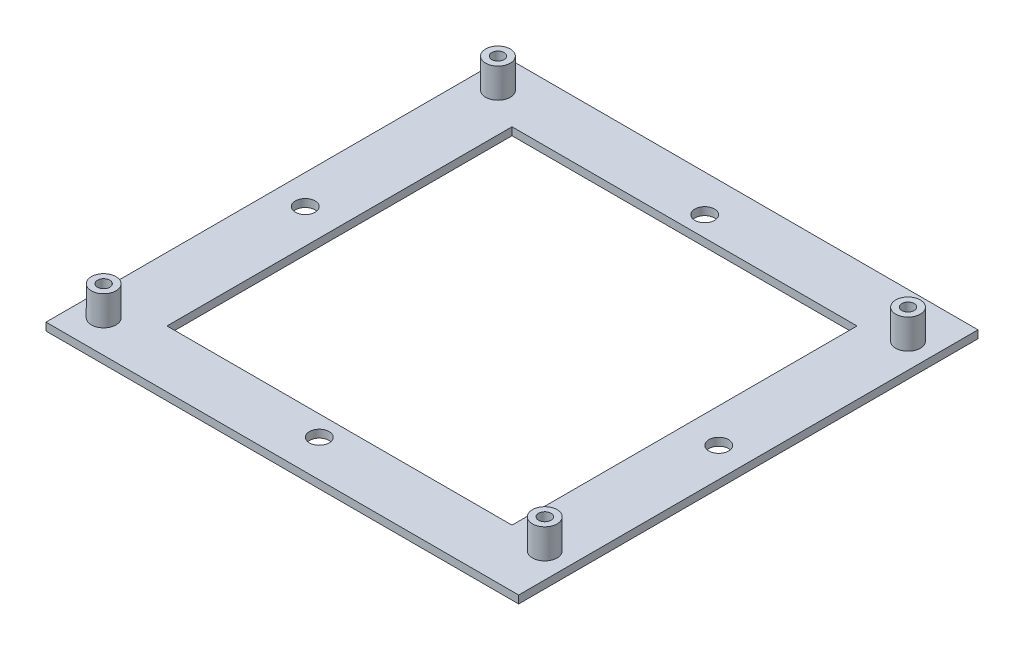
ISO-10303-21;
HEADER;
FILE_DESCRIPTION(('STEP AP214'),'2;1');
FILE_NAME('part.step','',(''),(''),'','','');
FILE_SCHEMA(('AUTOMOTIVE_DESIGN { 1 0 10303 214 1 1 1 1 }'));
ENDSEC;
DATA;
#1=APPLICATION_CONTEXT('core data for automotive mechanical design processes');
#2=APPLICATION_PROTOCOL_DEFINITION('international standard','automotive_design',2000,#1);
#3=PRODUCT_CONTEXT('',#1,'mechanical');
#4=PRODUCT('Part','Part','',(#3));
#5=PRODUCT_RELATED_PRODUCT_CATEGORY('part','',(#4));
#6=PRODUCT_DEFINITION_FORMATION('','',#4);
#7=PRODUCT_DEFINITION_CONTEXT('part definition',#1,'design');
#8=PRODUCT_DEFINITION('design','',#6,#7);
#9=PRODUCT_DEFINITION_SHAPE('','',#8);
#10=(LENGTH_UNIT() NAMED_UNIT(*) SI_UNIT(.MILLI.,.METRE.));
#11=(NAMED_UNIT(*) PLANE_ANGLE_UNIT() SI_UNIT($,.RADIAN.));
#12=(NAMED_UNIT(*) SI_UNIT($,.STERADIAN.) SOLID_ANGLE_UNIT());
#13=UNCERTAINTY_MEASURE_WITH_UNIT(LENGTH_MEASURE(1.E-05),#10,'distance_accuracy_value','');
#14=(GEOMETRIC_REPRESENTATION_CONTEXT(3) GLOBAL_UNCERTAINTY_ASSIGNED_CONTEXT((#13)) GLOBAL_UNIT_ASSIGNED_CONTEXT((#10,
#11,#12)) REPRESENTATION_CONTEXT('',''));
#15=CARTESIAN_POINT('',(0.,0.,0.));
#16=DIRECTION('',(0.,0.,1.));
#17=DIRECTION('',(1.,0.,0.));
#18=AXIS2_PLACEMENT_3D('',#15,#16,#17);
#19=CARTESIAN_POINT('',(0.,1.58,0.));
#20=DIRECTION('',(0.,-1.,0.));
#21=DIRECTION('',(0.,0.,-1.));
#22=AXIS2_PLACEMENT_3D('',#19,#20,#21);
#23=PLANE('',#22);
#24=CARTESIAN_POINT('',(42.85,1.58,36.2));
#25=DIRECTION('',(0.,-1.,0.));
#26=DIRECTION('',(0.,0.,-1.));
#27=AXIS2_PLACEMENT_3D('',#24,#25,#26);
#28=CIRCLE('',#27,2.5);
#29=CARTESIAN_POINT('',(42.85,1.58,33.7));
#30=VERTEX_POINT('',#29);
#31=EDGE_CURVE('E11',#30,#30,#28,.F.);
#32=ORIENTED_EDGE('',*,*,#31,.F.);
#33=EDGE_LOOP('',(#32));
#34=FACE_BOUND('',#33,.T.);
#35=CARTESIAN_POINT('',(-42.85,1.58,40.));
#36=DIRECTION('',(0.,-1.,0.));
#37=DIRECTION('',(0.,0.,-1.));
#38=AXIS2_PLACEMENT_3D('',#35,#36,#37);
#39=CIRCLE('',#38,2.5);
#40=CARTESIAN_POINT('',(-42.85,1.58,37.5));
#41=VERTEX_POINT('',#40);
#42=EDGE_CURVE('E46',#41,#41,#39,.F.);
#43=ORIENTED_EDGE('',*,*,#42,.F.);
#44=EDGE_LOOP('',(#43));
#45=FACE_BOUND('',#44,.T.);
#46=CARTESIAN_POINT('',(42.85,1.58,-37.5));
#47=DIRECTION('',(0.,-1.,0.));
#48=DIRECTION('',(0.,0.,-1.));
#49=AXIS2_PLACEMENT_3D('',#46,#47,#48);
#50=CIRCLE('',#49,2.5);
#51=CARTESIAN_POINT('',(42.85,1.58,-40.));
#52=VERTEX_POINT('',#51);
#53=EDGE_CURVE('E242',#52,#52,#50,.F.);
#54=ORIENTED_EDGE('',*,*,#53,.F.);
#55=EDGE_LOOP('',(#54));
#56=FACE_BOUND('',#55,.T.);
#57=CARTESIAN_POINT('',(-42.85,1.58,-40.));
#58=DIRECTION('',(0.,-1.,0.));
#59=DIRECTION('',(0.,0.,-1.));
#60=AXIS2_PLACEMENT_3D('',#57,#58,#59);
#61=CIRCLE('',#60,2.5);
#62=CARTESIAN_POINT('',(-42.85,1.58,-42.5));
#63=VERTEX_POINT('',#62);
#64=EDGE_CURVE('E239',#63,#63,#61,.F.);
#65=ORIENTED_EDGE('',*,*,#64,.F.);
#66=EDGE_LOOP('',(#65));
#67=FACE_BOUND('',#66,.T.);
#68=DIRECTION('',(0.,0.,-1.));
#69=VECTOR('',#68,1.);
#70=CARTESIAN_POINT('',(47.95,1.58,46.6));
#71=LINE('',#70,#69);
#72=CARTESIAN_POINT('',(47.95,1.58,46.6));
#73=VERTEX_POINT('',#72);
#74=CARTESIAN_POINT('',(47.95,1.58,-46.6));
#75=VERTEX_POINT('',#74);
#76=EDGE_CURVE('E210',#73,#75,#71,.T.);
#77=ORIENTED_EDGE('',*,*,#76,.T.);
#78=DIRECTION('',(-1.,0.,0.));
#79=VECTOR('',#78,1.);
#80=CARTESIAN_POINT('',(-47.95,1.58,-46.6));
#81=LINE('',#80,#79);
#82=CARTESIAN_POINT('',(-47.95,1.58,-46.6));
#83=VERTEX_POINT('',#82);
#84=EDGE_CURVE('E213',#75,#83,#81,.T.);
#85=ORIENTED_EDGE('',*,*,#84,.T.);
#86=DIRECTION('',(0.,0.,1.));
#87=VECTOR('',#86,1.);
#88=CARTESIAN_POINT('',(-47.95,1.58,46.6));
#89=LINE('',#88,#87);
#90=CARTESIAN_POINT('',(-47.95,1.58,46.6));
#91=VERTEX_POINT('',#90);
#92=EDGE_CURVE('E216',#83,#91,#89,.T.);
#93=ORIENTED_EDGE('',*,*,#92,.T.);
#94=DIRECTION('',(1.,0.,0.));
#95=VECTOR('',#94,1.);
#96=CARTESIAN_POINT('',(-47.95,1.58,46.6));
#97=LINE('',#96,#95);
#98=EDGE_CURVE('E218',#91,#73,#97,.T.);
#99=ORIENTED_EDGE('',*,*,#98,.T.);
#100=EDGE_LOOP('',(#77,#85,#93,#99));
#101=FACE_BOUND('',#100,.T.);
#102=DIRECTION('',(0.,0.,-1.));
#103=VECTOR('',#102,1.);
#104=CARTESIAN_POINT('',(35.,1.58,35.));
#105=LINE('',#104,#103);
#106=CARTESIAN_POINT('',(35.,1.58,35.));
#107=VERTEX_POINT('',#106);
#108=CARTESIAN_POINT('',(35.,1.58,-35.));
#109=VERTEX_POINT('',#108);
#110=EDGE_CURVE('E184',#107,#109,#105,.T.);
#111=ORIENTED_EDGE('',*,*,#110,.F.);
#112=DIRECTION('',(1.,0.,0.));
#113=VECTOR('',#112,1.);
#114=CARTESIAN_POINT('',(-35.,1.58,35.));
#115=LINE('',#114,#113);
#116=CARTESIAN_POINT('',(-35.,1.58,35.));
#117=VERTEX_POINT('',#116);
#118=EDGE_CURVE('E191',#117,#107,#115,.T.);
#119=ORIENTED_EDGE('',*,*,#118,.F.);
#120=DIRECTION('',(0.,0.,1.));
#121=VECTOR('',#120,1.);
#122=CARTESIAN_POINT('',(-35.,1.58,35.));
#123=LINE('',#122,#121);
#124=CARTESIAN_POINT('',(-35.,1.58,-35.));
#125=VERTEX_POINT('',#124);
#126=EDGE_CURVE('E189',#125,#117,#123,.T.);
#127=ORIENTED_EDGE('',*,*,#126,.F.);
#128=DIRECTION('',(-1.,0.,0.));
#129=VECTOR('',#128,1.);
#130=CARTESIAN_POINT('',(-35.,1.58,-35.));
#131=LINE('',#130,#129);
#132=EDGE_CURVE('E186',#109,#125,#131,.T.);
#133=ORIENTED_EDGE('',*,*,#132,.F.);
#134=EDGE_LOOP('',(#111,#119,#127,#133));
#135=FACE_BOUND('',#134,.T.);
#136=CARTESIAN_POINT('',(-1.22639132540952E-13,1.58,-39.1));
#137=DIRECTION('',(0.,1.,0.));
#138=DIRECTION('',(0.,0.,1.));
#139=AXIS2_PLACEMENT_3D('',#136,#137,#138);
#140=CIRCLE('',#139,2.);
#141=CARTESIAN_POINT('',(-1.22639132540952E-13,1.58,-37.1));
#142=VERTEX_POINT('',#141);
#143=EDGE_CURVE('E179',#142,#142,#140,.T.);
#144=ORIENTED_EDGE('',*,*,#143,.F.);
#145=EDGE_LOOP('',(#144));
#146=FACE_BOUND('',#145,.T.);
#147=CARTESIAN_POINT('',(41.95,1.58,0.));
#148=DIRECTION('',(0.,1.,0.));
#149=DIRECTION('',(0.,0.,1.));
#150=AXIS2_PLACEMENT_3D('',#147,#148,#149);
#151=CIRCLE('',#150,2.);
#152=CARTESIAN_POINT('',(41.95,1.58,2.));
#153=VERTEX_POINT('',#152);
#154=EDGE_CURVE('E173',#153,#153,#151,.T.);
#155=ORIENTED_EDGE('',*,*,#154,.F.);
#156=EDGE_LOOP('',(#155));
#157=FACE_BOUND('',#156,.T.);
#158=CARTESIAN_POINT('',(-41.95,1.58,0.));
#159=DIRECTION('',(0.,1.,0.));
#160=DIRECTION('',(0.,0.,1.));
#161=AXIS2_PLACEMENT_3D('',#158,#159,#160);
#162=CIRCLE('',#161,2.);
#163=CARTESIAN_POINT('',(-41.95,1.58,2.));
#164=VERTEX_POINT('',#163);
#165=EDGE_CURVE('E167',#164,#164,#162,.T.);
#166=ORIENTED_EDGE('',*,*,#165,.F.);
#167=EDGE_LOOP('',(#166));
#168=FACE_BOUND('',#167,.T.);
#169=CARTESIAN_POINT('',(1.50394708156581E-13,1.58,39.1));
#170=DIRECTION('',(0.,1.,0.));
#171=DIRECTION('',(0.,0.,1.));
#172=AXIS2_PLACEMENT_3D('',#169,#170,#171);
#173=CIRCLE('',#172,2.);
#174=CARTESIAN_POINT('',(1.50394708156581E-13,1.58,41.1));
#175=VERTEX_POINT('',#174);
#176=EDGE_CURVE('E161',#175,#175,#173,.T.);
#177=ORIENTED_EDGE('',*,*,#176,.F.);
#178=EDGE_LOOP('',(#177));
#179=FACE_BOUND('',#178,.T.);
#180=ADVANCED_FACE('F38',(#34,#45,#56,#67,#101,#135,#146,#157,#168,#179),#23,.F.);
#181=CARTESIAN_POINT('',(0.,0.,0.));
#182=DIRECTION('',(0.,-1.,0.));
#183=DIRECTION('',(0.,0.,-1.));
#184=AXIS2_PLACEMENT_3D('',#181,#182,#183);
#185=PLANE('',#184);
#186=CARTESIAN_POINT('',(-41.95,0.,0.));
#187=DIRECTION('',(0.,1.,0.));
#188=DIRECTION('',(0.,0.,1.));
#189=AXIS2_PLACEMENT_3D('',#186,#187,#188);
#190=CIRCLE('',#189,2.);
#191=CARTESIAN_POINT('',(-41.95,0.,2.));
#192=VERTEX_POINT('',#191);
#193=EDGE_CURVE('E164',#192,#192,#190,.T.);
#194=ORIENTED_EDGE('',*,*,#193,.T.);
#195=EDGE_LOOP('',(#194));
#196=FACE_BOUND('',#195,.T.);
#197=CARTESIAN_POINT('',(-1.22639132540952E-13,0.,-39.1));
#198=DIRECTION('',(0.,1.,0.));
#199=DIRECTION('',(0.,0.,1.));
#200=AXIS2_PLACEMENT_3D('',#197,#198,#199);
#201=CIRCLE('',#200,2.);
#202=CARTESIAN_POINT('',(-1.22639132540952E-13,0.,-37.1));
#203=VERTEX_POINT('',#202);
#204=EDGE_CURVE('E176',#203,#203,#201,.T.);
#205=ORIENTED_EDGE('',*,*,#204,.T.);
#206=EDGE_LOOP('',(#205));
#207=FACE_BOUND('',#206,.T.);
#208=DIRECTION('',(0.,0.,-1.));
#209=VECTOR('',#208,1.);
#210=CARTESIAN_POINT('',(47.95,0.,46.6));
#211=LINE('',#210,#209);
#212=CARTESIAN_POINT('',(47.95,0.,46.6));
#213=VERTEX_POINT('',#212);
#214=CARTESIAN_POINT('',(47.95,0.,-46.6));
#215=VERTEX_POINT('',#214);
#216=EDGE_CURVE('E209',#213,#215,#211,.T.);
#217=ORIENTED_EDGE('',*,*,#216,.F.);
#218=DIRECTION('',(1.,0.,0.));
#219=VECTOR('',#218,1.);
#220=CARTESIAN_POINT('',(-47.95,0.,46.6));
#221=LINE('',#220,#219);
#222=CARTESIAN_POINT('',(-47.95,0.,46.6));
#223=VERTEX_POINT('',#222);
#224=EDGE_CURVE('E214',#223,#213,#221,.T.);
#225=ORIENTED_EDGE('',*,*,#224,.F.);
#226=DIRECTION('',(0.,0.,1.));
#227=VECTOR('',#226,1.);
#228=CARTESIAN_POINT('',(-47.95,0.,46.6));
#229=LINE('',#228,#227);
#230=CARTESIAN_POINT('',(-47.95,0.,-46.6));
#231=VERTEX_POINT('',#230);
#232=EDGE_CURVE('E225',#231,#223,#229,.T.);
#233=ORIENTED_EDGE('',*,*,#232,.F.);
#234=DIRECTION('',(-1.,0.,0.));
#235=VECTOR('',#234,1.);
#236=CARTESIAN_POINT('',(-47.95,0.,-46.6));
#237=LINE('',#236,#235);
#238=EDGE_CURVE('E223',#215,#231,#237,.T.);
#239=ORIENTED_EDGE('',*,*,#238,.F.);
#240=EDGE_LOOP('',(#217,#225,#233,#239));
#241=FACE_BOUND('',#240,.T.);
#242=DIRECTION('',(1.,0.,0.));
#243=VECTOR('',#242,1.);
#244=CARTESIAN_POINT('',(-35.,0.,35.));
#245=LINE('',#244,#243);
#246=CARTESIAN_POINT('',(-35.,0.,35.));
#247=VERTEX_POINT('',#246);
#248=CARTESIAN_POINT('',(35.,0.,35.));
#249=VERTEX_POINT('',#248);
#250=EDGE_CURVE('E187',#247,#249,#245,.T.);
#251=ORIENTED_EDGE('',*,*,#250,.T.);
#252=DIRECTION('',(0.,0.,-1.));
#253=VECTOR('',#252,1.);
#254=CARTESIAN_POINT('',(35.,0.,35.));
#255=LINE('',#254,#253);
#256=CARTESIAN_POINT('',(35.,0.,-35.));
#257=VERTEX_POINT('',#256);
#258=EDGE_CURVE('E61',#249,#257,#255,.T.);
#259=ORIENTED_EDGE('',*,*,#258,.T.);
#260=DIRECTION('',(-1.,0.,0.));
#261=VECTOR('',#260,1.);
#262=CARTESIAN_POINT('',(-35.,0.,-35.));
#263=LINE('',#262,#261);
#264=CARTESIAN_POINT('',(-35.,0.,-35.));
#265=VERTEX_POINT('',#264);
#266=EDGE_CURVE('E195',#257,#265,#263,.T.);
#267=ORIENTED_EDGE('',*,*,#266,.T.);
#268=DIRECTION('',(0.,0.,1.));
#269=VECTOR('',#268,1.);
#270=CARTESIAN_POINT('',(-35.,0.,35.));
#271=LINE('',#270,#269);
#272=EDGE_CURVE('E198',#265,#247,#271,.T.);
#273=ORIENTED_EDGE('',*,*,#272,.T.);
#274=EDGE_LOOP('',(#251,#259,#267,#273));
#275=FACE_BOUND('',#274,.T.);
#276=CARTESIAN_POINT('',(41.95,0.,0.));
#277=DIRECTION('',(0.,1.,0.));
#278=DIRECTION('',(0.,0.,1.));
#279=AXIS2_PLACEMENT_3D('',#276,#277,#278);
#280=CIRCLE('',#279,2.);
#281=CARTESIAN_POINT('',(41.95,0.,2.));
#282=VERTEX_POINT('',#281);
#283=EDGE_CURVE('E170',#282,#282,#280,.T.);
#284=ORIENTED_EDGE('',*,*,#283,.T.);
#285=EDGE_LOOP('',(#284));
#286=FACE_BOUND('',#285,.T.);
#287=CARTESIAN_POINT('',(1.50394708156581E-13,0.,39.1));
#288=DIRECTION('',(0.,1.,0.));
#289=DIRECTION('',(0.,0.,1.));
#290=AXIS2_PLACEMENT_3D('',#287,#288,#289);
#291=CIRCLE('',#290,2.);
#292=CARTESIAN_POINT('',(1.50394708156581E-13,0.,41.1));
#293=VERTEX_POINT('',#292);
#294=EDGE_CURVE('E160',#293,#293,#291,.T.);
#295=ORIENTED_EDGE('',*,*,#294,.T.);
#296=EDGE_LOOP('',(#295));
#297=FACE_BOUND('',#296,.T.);
#298=ADVANCED_FACE('F251',(#196,#207,#241,#275,#286,#297),#185,.T.);
#299=CARTESIAN_POINT('',(47.95,1.58,46.6));
#300=DIRECTION('',(-1.,0.,0.));
#301=DIRECTION('',(0.,0.,1.));
#302=AXIS2_PLACEMENT_3D('',#299,#300,#301);
#303=PLANE('',#302);
#304=ORIENTED_EDGE('',*,*,#216,.T.);
#305=DIRECTION('',(0.,-1.,0.));
#306=VECTOR('',#305,1.);
#307=CARTESIAN_POINT('',(47.95,1.58,-46.6));
#308=LINE('',#307,#306);
#309=EDGE_CURVE('E236',#75,#215,#308,.T.);
#310=ORIENTED_EDGE('',*,*,#309,.F.);
#311=ORIENTED_EDGE('',*,*,#76,.F.);
#312=DIRECTION('',(0.,-1.,0.));
#313=VECTOR('',#312,1.);
#314=CARTESIAN_POINT('',(47.95,1.58,46.6));
#315=LINE('',#314,#313);
#316=EDGE_CURVE('E220',#73,#213,#315,.T.);
#317=ORIENTED_EDGE('',*,*,#316,.T.);
#318=EDGE_LOOP('',(#304,#310,#311,#317));
#319=FACE_BOUND('',#318,.T.);
#320=ADVANCED_FACE('F40',(#319),#303,.F.);
#321=CARTESIAN_POINT('',(-47.95,1.58,-46.6));
#322=DIRECTION('',(0.,0.,1.));
#323=DIRECTION('',(1.,0.,0.));
#324=AXIS2_PLACEMENT_3D('',#321,#322,#323);
#325=PLANE('',#324);
#326=ORIENTED_EDGE('',*,*,#238,.T.);
#327=DIRECTION('',(0.,-1.,0.));
#328=VECTOR('',#327,1.);
#329=CARTESIAN_POINT('',(-47.95,1.58,-46.6));
#330=LINE('',#329,#328);
#331=EDGE_CURVE('E233',#83,#231,#330,.T.);
#332=ORIENTED_EDGE('',*,*,#331,.F.);
#333=ORIENTED_EDGE('',*,*,#84,.F.);
#334=ORIENTED_EDGE('',*,*,#309,.T.);
#335=EDGE_LOOP('',(#326,#332,#333,#334));
#336=FACE_BOUND('',#335,.T.);
#337=ADVANCED_FACE('F287',(#336),#325,.F.);
#338=CARTESIAN_POINT('',(-47.95,1.58,46.6));
#339=DIRECTION('',(1.,0.,0.));
#340=DIRECTION('',(0.,0.,-1.));
#341=AXIS2_PLACEMENT_3D('',#338,#339,#340);
#342=PLANE('',#341);
#343=ORIENTED_EDGE('',*,*,#232,.T.);
#344=DIRECTION('',(0.,-1.,0.));
#345=VECTOR('',#344,1.);
#346=CARTESIAN_POINT('',(-47.95,1.58,46.6));
#347=LINE('',#346,#345);
#348=EDGE_CURVE('E230',#91,#223,#347,.T.);
#349=ORIENTED_EDGE('',*,*,#348,.F.);
#350=ORIENTED_EDGE('',*,*,#92,.F.);
#351=ORIENTED_EDGE('',*,*,#331,.T.);
#352=EDGE_LOOP('',(#343,#349,#350,#351));
#353=FACE_BOUND('',#352,.T.);
#354=ADVANCED_FACE('F296',(#353),#342,.F.);
#355=CARTESIAN_POINT('',(-47.95,1.58,46.6));
#356=DIRECTION('',(0.,0.,-1.));
#357=DIRECTION('',(-1.,0.,0.));
#358=AXIS2_PLACEMENT_3D('',#355,#356,#357);
#359=PLANE('',#358);
#360=ORIENTED_EDGE('',*,*,#224,.T.);
#361=ORIENTED_EDGE('',*,*,#316,.F.);
#362=ORIENTED_EDGE('',*,*,#98,.F.);
#363=ORIENTED_EDGE('',*,*,#348,.T.);
#364=EDGE_LOOP('',(#360,#361,#362,#363));
#365=FACE_BOUND('',#364,.T.);
#366=ADVANCED_FACE('F292',(#365),#359,.F.);
#367=CARTESIAN_POINT('',(35.,1.58,35.));
#368=DIRECTION('',(-1.,0.,0.));
#369=DIRECTION('',(0.,0.,1.));
#370=AXIS2_PLACEMENT_3D('',#367,#368,#369);
#371=PLANE('',#370);
#372=ORIENTED_EDGE('',*,*,#258,.F.);
#373=DIRECTION('',(0.,-1.,0.));
#374=VECTOR('',#373,1.);
#375=CARTESIAN_POINT('',(35.,1.58,35.));
#376=LINE('',#375,#374);
#377=EDGE_CURVE('E193',#107,#249,#376,.T.);
#378=ORIENTED_EDGE('',*,*,#377,.F.);
#379=ORIENTED_EDGE('',*,*,#110,.T.);
#380=DIRECTION('',(0.,-1.,0.));
#381=VECTOR('',#380,1.);
#382=CARTESIAN_POINT('',(35.,1.58,-35.));
#383=LINE('',#382,#381);
#384=EDGE_CURVE('E207',#109,#257,#383,.T.);
#385=ORIENTED_EDGE('',*,*,#384,.T.);
#386=EDGE_LOOP('',(#372,#378,#379,#385));
#387=FACE_BOUND('',#386,.T.);
#388=ADVANCED_FACE('F295',(#387),#371,.T.);
#389=CARTESIAN_POINT('',(-35.,1.58,-35.));
#390=DIRECTION('',(0.,0.,1.));
#391=DIRECTION('',(1.,0.,0.));
#392=AXIS2_PLACEMENT_3D('',#389,#390,#391);
#393=PLANE('',#392);
#394=ORIENTED_EDGE('',*,*,#266,.F.);
#395=ORIENTED_EDGE('',*,*,#384,.F.);
#396=ORIENTED_EDGE('',*,*,#132,.T.);
#397=DIRECTION('',(0.,-1.,0.));
#398=VECTOR('',#397,1.);
#399=CARTESIAN_POINT('',(-35.,1.58,-35.));
#400=LINE('',#399,#398);
#401=EDGE_CURVE('E205',#125,#265,#400,.T.);
#402=ORIENTED_EDGE('',*,*,#401,.T.);
#403=EDGE_LOOP('',(#394,#395,#396,#402));
#404=FACE_BOUND('',#403,.T.);
#405=ADVANCED_FACE('F337',(#404),#393,.T.);
#406=CARTESIAN_POINT('',(-35.,1.58,35.));
#407=DIRECTION('',(1.,0.,0.));
#408=DIRECTION('',(0.,0.,-1.));
#409=AXIS2_PLACEMENT_3D('',#406,#407,#408);
#410=PLANE('',#409);
#411=ORIENTED_EDGE('',*,*,#272,.F.);
#412=ORIENTED_EDGE('',*,*,#401,.F.);
#413=ORIENTED_EDGE('',*,*,#126,.T.);
#414=DIRECTION('',(0.,-1.,0.));
#415=VECTOR('',#414,1.);
#416=CARTESIAN_POINT('',(-35.,1.58,35.));
#417=LINE('',#416,#415);
#418=EDGE_CURVE('E53',#117,#247,#417,.T.);
#419=ORIENTED_EDGE('',*,*,#418,.T.);
#420=EDGE_LOOP('',(#411,#412,#413,#419));
#421=FACE_BOUND('',#420,.T.);
#422=ADVANCED_FACE('F334',(#421),#410,.T.);
#423=CARTESIAN_POINT('',(-35.,1.58,35.));
#424=DIRECTION('',(0.,0.,-1.));
#425=DIRECTION('',(-1.,0.,0.));
#426=AXIS2_PLACEMENT_3D('',#423,#424,#425);
#427=PLANE('',#426);
#428=ORIENTED_EDGE('',*,*,#250,.F.);
#429=ORIENTED_EDGE('',*,*,#418,.F.);
#430=ORIENTED_EDGE('',*,*,#118,.T.);
#431=ORIENTED_EDGE('',*,*,#377,.T.);
#432=EDGE_LOOP('',(#428,#429,#430,#431));
#433=FACE_BOUND('',#432,.T.);
#434=ADVANCED_FACE('F328',(#433),#427,.T.);
#435=CARTESIAN_POINT('',(-1.22639132540952E-13,1.58,-39.1));
#436=DIRECTION('',(0.,-1.,0.));
#437=DIRECTION('',(0.,0.,-1.));
#438=AXIS2_PLACEMENT_3D('',#435,#436,#437);
#439=CYLINDRICAL_SURFACE('',#438,2.);
#440=ORIENTED_EDGE('',*,*,#143,.T.);
#441=EDGE_LOOP('',(#440));
#442=FACE_BOUND('',#441,.T.);
#443=ORIENTED_EDGE('',*,*,#204,.F.);
#444=EDGE_LOOP('',(#443));
#445=FACE_BOUND('',#444,.T.);
#446=ADVANCED_FACE('F319',(#442,#445),#439,.F.);
#447=CARTESIAN_POINT('',(41.95,1.58,0.));
#448=DIRECTION('',(0.,-1.,0.));
#449=DIRECTION('',(0.,0.,-1.));
#450=AXIS2_PLACEMENT_3D('',#447,#448,#449);
#451=CYLINDRICAL_SURFACE('',#450,2.);
#452=ORIENTED_EDGE('',*,*,#154,.T.);
#453=EDGE_LOOP('',(#452));
#454=FACE_BOUND('',#453,.T.);
#455=ORIENTED_EDGE('',*,*,#283,.F.);
#456=EDGE_LOOP('',(#455));
#457=FACE_BOUND('',#456,.T.);
#458=ADVANCED_FACE('F317',(#454,#457),#451,.F.);
#459=CARTESIAN_POINT('',(-41.95,1.58,0.));
#460=DIRECTION('',(0.,-1.,0.));
#461=DIRECTION('',(0.,0.,-1.));
#462=AXIS2_PLACEMENT_3D('',#459,#460,#461);
#463=CYLINDRICAL_SURFACE('',#462,2.);
#464=ORIENTED_EDGE('',*,*,#165,.T.);
#465=EDGE_LOOP('',(#464));
#466=FACE_BOUND('',#465,.T.);
#467=ORIENTED_EDGE('',*,*,#193,.F.);
#468=EDGE_LOOP('',(#467));
#469=FACE_BOUND('',#468,.T.);
#470=ADVANCED_FACE('F277',(#466,#469),#463,.F.);
#471=CARTESIAN_POINT('',(1.50394708156581E-13,1.58,39.1));
#472=DIRECTION('',(0.,-1.,0.));
#473=DIRECTION('',(0.,0.,-1.));
#474=AXIS2_PLACEMENT_3D('',#471,#472,#473);
#475=CYLINDRICAL_SURFACE('',#474,2.);
#476=ORIENTED_EDGE('',*,*,#176,.T.);
#477=EDGE_LOOP('',(#476));
#478=FACE_BOUND('',#477,.T.);
#479=ORIENTED_EDGE('',*,*,#294,.F.);
#480=EDGE_LOOP('',(#479));
#481=FACE_BOUND('',#480,.T.);
#482=ADVANCED_FACE('F273',(#478,#481),#475,.F.);
#483=CARTESIAN_POINT('',(-42.85,7.58,-40.));
#484=DIRECTION('',(0.,-1.,0.));
#485=DIRECTION('',(0.,0.,-1.));
#486=AXIS2_PLACEMENT_3D('',#483,#484,#485);
#487=CYLINDRICAL_SURFACE('',#486,2.5);
#488=CARTESIAN_POINT('',(-42.85,7.58,-40.));
#489=DIRECTION('',(0.,1.,0.));
#490=DIRECTION('',(0.,0.,1.));
#491=AXIS2_PLACEMENT_3D('',#488,#489,#490);
#492=CIRCLE('',#491,2.5);
#493=CARTESIAN_POINT('',(-42.85,7.58,-37.5));
#494=VERTEX_POINT('',#493);
#495=EDGE_CURVE('E157',#494,#494,#492,.T.);
#496=ORIENTED_EDGE('',*,*,#495,.F.);
#497=EDGE_LOOP('',(#496));
#498=FACE_BOUND('',#497,.T.);
#499=ORIENTED_EDGE('',*,*,#64,.T.);
#500=EDGE_LOOP('',(#499));
#501=FACE_BOUND('',#500,.T.);
#502=ADVANCED_FACE('F276',(#498,#501),#487,.T.);
#503=CARTESIAN_POINT('',(-42.85,7.58,-40.));
#504=DIRECTION('',(0.,1.,0.));
#505=DIRECTION('',(0.,0.,1.));
#506=AXIS2_PLACEMENT_3D('',#503,#504,#505);
#507=PLANE('',#506);
#508=CARTESIAN_POINT('',(-42.85,7.58,-40.));
#509=DIRECTION('',(0.,1.,0.));
#510=DIRECTION('',(0.,0.,1.));
#511=AXIS2_PLACEMENT_3D('',#508,#509,#510);
#512=CIRCLE('',#511,1.24999999999999);
#513=CARTESIAN_POINT('',(-42.85,7.58,-38.75));
#514=VERTEX_POINT('',#513);
#515=EDGE_CURVE('E126',#514,#514,#512,.T.);
#516=ORIENTED_EDGE('',*,*,#515,.F.);
#517=EDGE_LOOP('',(#516));
#518=FACE_BOUND('',#517,.T.);
#519=ORIENTED_EDGE('',*,*,#495,.T.);
#520=EDGE_LOOP('',(#519));
#521=FACE_BOUND('',#520,.T.);
#522=ADVANCED_FACE('F394',(#518,#521),#507,.T.);
#523=CARTESIAN_POINT('',(42.85,7.58,-37.5));
#524=DIRECTION('',(0.,-1.,0.));
#525=DIRECTION('',(0.,0.,-1.));
#526=AXIS2_PLACEMENT_3D('',#523,#524,#525);
#527=CYLINDRICAL_SURFACE('',#526,2.5);
#528=CARTESIAN_POINT('',(42.85,7.58,-37.5));
#529=DIRECTION('',(0.,1.,0.));
#530=DIRECTION('',(0.,0.,1.));
#531=AXIS2_PLACEMENT_3D('',#528,#529,#530);
#532=CIRCLE('',#531,2.5);
#533=CARTESIAN_POINT('',(42.85,7.58,-35.));
#534=VERTEX_POINT('',#533);
#535=EDGE_CURVE('E154',#534,#534,#532,.T.);
#536=ORIENTED_EDGE('',*,*,#535,.F.);
#537=EDGE_LOOP('',(#536));
#538=FACE_BOUND('',#537,.T.);
#539=ORIENTED_EDGE('',*,*,#53,.T.);
#540=EDGE_LOOP('',(#539));
#541=FACE_BOUND('',#540,.T.);
#542=ADVANCED_FACE('F402',(#538,#541),#527,.T.);
#543=CARTESIAN_POINT('',(42.85,7.58,-37.5));
#544=DIRECTION('',(0.,1.,0.));
#545=DIRECTION('',(0.,0.,1.));
#546=AXIS2_PLACEMENT_3D('',#543,#544,#545);
#547=PLANE('',#546);
#548=CARTESIAN_POINT('',(42.85,7.58,-37.5));
#549=DIRECTION('',(0.,1.,0.));
#550=DIRECTION('',(0.,0.,1.));
#551=AXIS2_PLACEMENT_3D('',#548,#549,#550);
#552=CIRCLE('',#551,1.24999999999999);
#553=CARTESIAN_POINT('',(42.85,7.58,-36.25));
#554=VERTEX_POINT('',#553);
#555=EDGE_CURVE('E142',#554,#554,#552,.T.);
#556=ORIENTED_EDGE('',*,*,#555,.F.);
#557=EDGE_LOOP('',(#556));
#558=FACE_BOUND('',#557,.T.);
#559=ORIENTED_EDGE('',*,*,#535,.T.);
#560=EDGE_LOOP('',(#559));
#561=FACE_BOUND('',#560,.T.);
#562=ADVANCED_FACE('F407',(#558,#561),#547,.T.);
#563=CARTESIAN_POINT('',(-42.85,7.58,40.));
#564=DIRECTION('',(0.,-1.,0.));
#565=DIRECTION('',(0.,0.,-1.));
#566=AXIS2_PLACEMENT_3D('',#563,#564,#565);
#567=CYLINDRICAL_SURFACE('',#566,2.5);
#568=CARTESIAN_POINT('',(-42.85,7.58,40.));
#569=DIRECTION('',(0.,1.,0.));
#570=DIRECTION('',(0.,0.,1.));
#571=AXIS2_PLACEMENT_3D('',#568,#569,#570);
#572=CIRCLE('',#571,2.5);
#573=CARTESIAN_POINT('',(-42.85,7.58,42.5));
#574=VERTEX_POINT('',#573);
#575=EDGE_CURVE('E151',#574,#574,#572,.T.);
#576=ORIENTED_EDGE('',*,*,#575,.F.);
#577=EDGE_LOOP('',(#576));
#578=FACE_BOUND('',#577,.T.);
#579=ORIENTED_EDGE('',*,*,#42,.T.);
#580=EDGE_LOOP('',(#579));
#581=FACE_BOUND('',#580,.T.);
#582=ADVANCED_FACE('F247',(#578,#581),#567,.T.);
#583=CARTESIAN_POINT('',(-42.85,7.58,40.));
#584=DIRECTION('',(0.,1.,0.));
#585=DIRECTION('',(0.,0.,1.));
#586=AXIS2_PLACEMENT_3D('',#583,#584,#585);
#587=PLANE('',#586);
#588=CARTESIAN_POINT('',(-42.85,7.58,40.));
#589=DIRECTION('',(0.,1.,0.));
#590=DIRECTION('',(0.,0.,1.));
#591=AXIS2_PLACEMENT_3D('',#588,#589,#590);
#592=CIRCLE('',#591,1.24999999999999);
#593=CARTESIAN_POINT('',(-42.85,7.58,41.25));
#594=VERTEX_POINT('',#593);
#595=EDGE_CURVE('E125',#594,#594,#592,.T.);
#596=ORIENTED_EDGE('',*,*,#595,.F.);
#597=EDGE_LOOP('',(#596));
#598=FACE_BOUND('',#597,.T.);
#599=ORIENTED_EDGE('',*,*,#575,.T.);
#600=EDGE_LOOP('',(#599));
#601=FACE_BOUND('',#600,.T.);
#602=ADVANCED_FACE('F419',(#598,#601),#587,.T.);
#603=CARTESIAN_POINT('',(42.85,7.58,36.2));
#604=DIRECTION('',(0.,-1.,0.));
#605=DIRECTION('',(0.,0.,-1.));
#606=AXIS2_PLACEMENT_3D('',#603,#604,#605);
#607=CYLINDRICAL_SURFACE('',#606,2.5);
#608=CARTESIAN_POINT('',(42.85,7.58,36.2));
#609=DIRECTION('',(0.,1.,0.));
#610=DIRECTION('',(0.,0.,1.));
#611=AXIS2_PLACEMENT_3D('',#608,#609,#610);
#612=CIRCLE('',#611,2.5);
#613=CARTESIAN_POINT('',(42.85,7.58,38.7));
#614=VERTEX_POINT('',#613);
#615=EDGE_CURVE('E148',#614,#614,#612,.T.);
#616=ORIENTED_EDGE('',*,*,#615,.F.);
#617=EDGE_LOOP('',(#616));
#618=FACE_BOUND('',#617,.T.);
#619=ORIENTED_EDGE('',*,*,#31,.T.);
#620=EDGE_LOOP('',(#619));
#621=FACE_BOUND('',#620,.T.);
#622=ADVANCED_FACE('F427',(#618,#621),#607,.T.);
#623=CARTESIAN_POINT('',(42.85,7.58,36.2));
#624=DIRECTION('',(0.,1.,0.));
#625=DIRECTION('',(0.,0.,1.));
#626=AXIS2_PLACEMENT_3D('',#623,#624,#625);
#627=PLANE('',#626);
#628=CARTESIAN_POINT('',(42.85,7.58,36.2));
#629=DIRECTION('',(0.,1.,0.));
#630=DIRECTION('',(0.,0.,1.));
#631=AXIS2_PLACEMENT_3D('',#628,#629,#630);
#632=CIRCLE('',#631,1.24999999999999);
#633=CARTESIAN_POINT('',(42.85,7.58,37.45));
#634=VERTEX_POINT('',#633);
#635=EDGE_CURVE('E136',#634,#634,#632,.T.);
#636=ORIENTED_EDGE('',*,*,#635,.F.);
#637=EDGE_LOOP('',(#636));
#638=FACE_BOUND('',#637,.T.);
#639=ORIENTED_EDGE('',*,*,#615,.T.);
#640=EDGE_LOOP('',(#639));
#641=FACE_BOUND('',#640,.T.);
#642=ADVANCED_FACE('F432',(#638,#641),#627,.T.);
#643=CARTESIAN_POINT('',(42.85,1.58,-37.5));
#644=DIRECTION('',(0.,1.,0.));
#645=DIRECTION('',(0.,0.,1.));
#646=AXIS2_PLACEMENT_3D('',#643,#644,#645);
#647=CONICAL_SURFACE('',#646,1.25,1.02974425867665);
#648=CARTESIAN_POINT('',(42.85,0.828924226215549,-37.5));
#649=VERTEX_POINT('',#648);
#650=VERTEX_LOOP('',#649);
#651=FACE_BOUND('',#650,.T.);
#652=CARTESIAN_POINT('',(42.85,1.58,-37.5));
#653=DIRECTION('',(0.,1.,0.));
#654=DIRECTION('',(0.,0.,1.));
#655=AXIS2_PLACEMENT_3D('',#652,#653,#654);
#656=CIRCLE('',#655,1.25);
#657=CARTESIAN_POINT('',(42.85,1.58,-36.25));
#658=VERTEX_POINT('',#657);
#659=EDGE_CURVE('E145',#658,#658,#656,.T.);
#660=ORIENTED_EDGE('',*,*,#659,.T.);
#661=EDGE_LOOP('',(#660));
#662=FACE_BOUND('',#661,.T.);
#663=ADVANCED_FACE('F471',(#651,#662),#647,.F.);
#664=CARTESIAN_POINT('',(42.85,7.58,-37.5));
#665=DIRECTION('',(0.,1.,0.));
#666=DIRECTION('',(0.,0.,1.));
#667=AXIS2_PLACEMENT_3D('',#664,#665,#666);
#668=CYLINDRICAL_SURFACE('',#667,1.24999999999999);
#669=ORIENTED_EDGE('',*,*,#659,.F.);
#670=EDGE_LOOP('',(#669));
#671=FACE_BOUND('',#670,.T.);
#672=ORIENTED_EDGE('',*,*,#555,.T.);
#673=EDGE_LOOP('',(#672));
#674=FACE_BOUND('',#673,.T.);
#675=ADVANCED_FACE('F481',(#671,#674),#668,.F.);
#676=CARTESIAN_POINT('',(42.85,1.58,36.2));
#677=DIRECTION('',(0.,1.,0.));
#678=DIRECTION('',(0.,0.,1.));
#679=AXIS2_PLACEMENT_3D('',#676,#677,#678);
#680=CONICAL_SURFACE('',#679,1.25,1.02974425867665);
#681=CARTESIAN_POINT('',(42.85,0.828924226215549,36.2));
#682=VERTEX_POINT('',#681);
#683=VERTEX_LOOP('',#682);
#684=FACE_BOUND('',#683,.T.);
#685=CARTESIAN_POINT('',(42.85,1.58,36.2));
#686=DIRECTION('',(0.,1.,0.));
#687=DIRECTION('',(0.,0.,1.));
#688=AXIS2_PLACEMENT_3D('',#685,#686,#687);
#689=CIRCLE('',#688,1.25);
#690=CARTESIAN_POINT('',(42.85,1.58,37.45));
#691=VERTEX_POINT('',#690);
#692=EDGE_CURVE('E139',#691,#691,#689,.T.);
#693=ORIENTED_EDGE('',*,*,#692,.T.);
#694=EDGE_LOOP('',(#693));
#695=FACE_BOUND('',#694,.T.);
#696=ADVANCED_FACE('F492',(#684,#695),#680,.F.);
#697=CARTESIAN_POINT('',(42.85,7.58,36.2));
#698=DIRECTION('',(0.,1.,0.));
#699=DIRECTION('',(0.,0.,1.));
#700=AXIS2_PLACEMENT_3D('',#697,#698,#699);
#701=CYLINDRICAL_SURFACE('',#700,1.24999999999999);
#702=ORIENTED_EDGE('',*,*,#692,.F.);
#703=EDGE_LOOP('',(#702));
#704=FACE_BOUND('',#703,.T.);
#705=ORIENTED_EDGE('',*,*,#635,.T.);
#706=EDGE_LOOP('',(#705));
#707=FACE_BOUND('',#706,.T.);
#708=ADVANCED_FACE('F503',(#704,#707),#701,.F.);
#709=CARTESIAN_POINT('',(-42.85,1.58,40.));
#710=DIRECTION('',(0.,1.,0.));
#711=DIRECTION('',(0.,0.,1.));
#712=AXIS2_PLACEMENT_3D('',#709,#710,#711);
#713=CONICAL_SURFACE('',#712,1.25,1.02974425867665);
#714=CARTESIAN_POINT('',(-42.85,0.828924226215549,40.));
#715=VERTEX_POINT('',#714);
#716=VERTEX_LOOP('',#715);
#717=FACE_BOUND('',#716,.T.);
#718=CARTESIAN_POINT('',(-42.85,1.58,40.));
#719=DIRECTION('',(0.,1.,0.));
#720=DIRECTION('',(0.,0.,1.));
#721=AXIS2_PLACEMENT_3D('',#718,#719,#720);
#722=CIRCLE('',#721,1.25);
#723=CARTESIAN_POINT('',(-42.85,1.58,41.25));
#724=VERTEX_POINT('',#723);
#725=EDGE_CURVE('E129',#724,#724,#722,.T.);
#726=ORIENTED_EDGE('',*,*,#725,.T.);
#727=EDGE_LOOP('',(#726));
#728=FACE_BOUND('',#727,.T.);
#729=ADVANCED_FACE('F513',(#717,#728),#713,.F.);
#730=CARTESIAN_POINT('',(-42.85,7.58,40.));
#731=DIRECTION('',(0.,1.,0.));
#732=DIRECTION('',(0.,0.,1.));
#733=AXIS2_PLACEMENT_3D('',#730,#731,#732);
#734=CYLINDRICAL_SURFACE('',#733,1.24999999999999);
#735=ORIENTED_EDGE('',*,*,#725,.F.);
#736=EDGE_LOOP('',(#735));
#737=FACE_BOUND('',#736,.T.);
#738=ORIENTED_EDGE('',*,*,#595,.T.);
#739=EDGE_LOOP('',(#738));
#740=FACE_BOUND('',#739,.T.);
#741=ADVANCED_FACE('F119',(#737,#740),#734,.F.);
#742=CARTESIAN_POINT('',(-42.85,1.58,-40.));
#743=DIRECTION('',(0.,1.,0.));
#744=DIRECTION('',(0.,0.,1.));
#745=AXIS2_PLACEMENT_3D('',#742,#743,#744);
#746=CONICAL_SURFACE('',#745,1.25,1.02974425867665);
#747=CARTESIAN_POINT('',(-42.85,0.828924226215549,-40.));
#748=VERTEX_POINT('',#747);
#749=VERTEX_LOOP('',#748);
#750=FACE_BOUND('',#749,.T.);
#751=CARTESIAN_POINT('',(-42.85,1.58,-40.));
#752=DIRECTION('',(0.,1.,0.));
#753=DIRECTION('',(0.,0.,1.));
#754=AXIS2_PLACEMENT_3D('',#751,#752,#753);
#755=CIRCLE('',#754,1.25);
#756=CARTESIAN_POINT('',(-42.85,1.58,-38.75));
#757=VERTEX_POINT('',#756);
#758=EDGE_CURVE('E123',#757,#757,#755,.T.);
#759=ORIENTED_EDGE('',*,*,#758,.T.);
#760=EDGE_LOOP('',(#759));
#761=FACE_BOUND('',#760,.T.);
#762=ADVANCED_FACE('F115',(#750,#761),#746,.F.);
#763=CARTESIAN_POINT('',(-42.85,7.58,-40.));
#764=DIRECTION('',(0.,1.,0.));
#765=DIRECTION('',(0.,0.,1.));
#766=AXIS2_PLACEMENT_3D('',#763,#764,#765);
#767=CYLINDRICAL_SURFACE('',#766,1.24999999999999);
#768=ORIENTED_EDGE('',*,*,#758,.F.);
#769=EDGE_LOOP('',(#768));
#770=FACE_BOUND('',#769,.T.);
#771=ORIENTED_EDGE('',*,*,#515,.T.);
#772=EDGE_LOOP('',(#771));
#773=FACE_BOUND('',#772,.T.);
#774=ADVANCED_FACE('F118',(#770,#773),#767,.F.);
#775=CLOSED_SHELL('',(#180,#298,#320,#337,#354,#366,#388,#405,#422,#434,#446,#458,#470,#482,
#502,#522,#542,#562,#582,#602,#622,#642,#663,#675,#696,#708,#729,#741,#762,#774));
#776=MANIFOLD_SOLID_BREP('B2',#775);
#777=ADVANCED_BREP_SHAPE_REPRESENTATION('',(#18,#776),#14);
#778=SHAPE_DEFINITION_REPRESENTATION(#9,#777);
ENDSEC;
END-ISO-10303-21;
